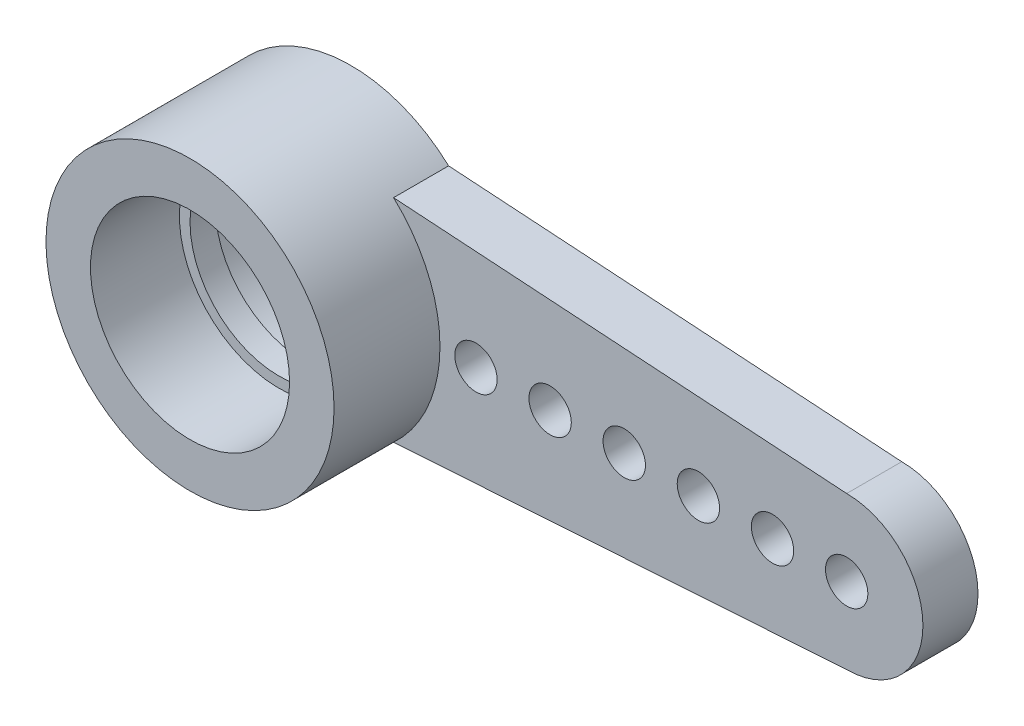
ISO-10303-21;
HEADER;
FILE_DESCRIPTION(('STEP AP214'),'2;1');
FILE_NAME('part.step','',(''),(''),'','','');
FILE_SCHEMA(('AUTOMOTIVE_DESIGN { 1 0 10303 214 1 1 1 1 }'));
ENDSEC;
DATA;
#1=APPLICATION_CONTEXT('core data for automotive mechanical design processes');
#2=APPLICATION_PROTOCOL_DEFINITION('international standard','automotive_design',2000,#1);
#3=PRODUCT_CONTEXT('',#1,'mechanical');
#4=PRODUCT('Part','Part','',(#3));
#5=PRODUCT_RELATED_PRODUCT_CATEGORY('part','',(#4));
#6=PRODUCT_DEFINITION_FORMATION('','',#4);
#7=PRODUCT_DEFINITION_CONTEXT('part definition',#1,'design');
#8=PRODUCT_DEFINITION('design','',#6,#7);
#9=PRODUCT_DEFINITION_SHAPE('','',#8);
#10=(LENGTH_UNIT() NAMED_UNIT(*) SI_UNIT(.MILLI.,.METRE.));
#11=(NAMED_UNIT(*) PLANE_ANGLE_UNIT() SI_UNIT($,.RADIAN.));
#12=(NAMED_UNIT(*) SI_UNIT($,.STERADIAN.) SOLID_ANGLE_UNIT());
#13=UNCERTAINTY_MEASURE_WITH_UNIT(LENGTH_MEASURE(1.E-05),#10,'distance_accuracy_value','');
#14=(GEOMETRIC_REPRESENTATION_CONTEXT(3) GLOBAL_UNCERTAINTY_ASSIGNED_CONTEXT((#13)) GLOBAL_UNIT_ASSIGNED_CONTEXT((#10,
#11,#12)) REPRESENTATION_CONTEXT('',''));
#15=CARTESIAN_POINT('',(0.,0.,0.));
#16=DIRECTION('',(0.,0.,1.));
#17=DIRECTION('',(1.,0.,0.));
#18=AXIS2_PLACEMENT_3D('',#15,#16,#17);
#19=CARTESIAN_POINT('',(0.,0.,-6.64680374315355));
#20=DIRECTION('',(0.,0.,1.));
#21=DIRECTION('',(1.,0.,0.));
#22=AXIS2_PLACEMENT_3D('',#19,#20,#21);
#23=CYLINDRICAL_SURFACE('',#22,2.35);
#24=CARTESIAN_POINT('',(0.,0.,1.1));
#25=DIRECTION('',(0.,0.,-1.));
#26=DIRECTION('',(-1.,0.,0.));
#27=AXIS2_PLACEMENT_3D('',#24,#25,#26);
#28=CIRCLE('',#27,2.35);
#29=CARTESIAN_POINT('',(-2.35,0.,1.1));
#30=VERTEX_POINT('',#29);
#31=EDGE_CURVE('E151',#30,#30,#28,.T.);
#32=ORIENTED_EDGE('',*,*,#31,.F.);
#33=EDGE_LOOP('',(#32));
#34=FACE_BOUND('',#33,.T.);
#35=CARTESIAN_POINT('',(0.,0.,0.));
#36=DIRECTION('',(0.,0.,1.));
#37=DIRECTION('',(1.,0.,0.));
#38=AXIS2_PLACEMENT_3D('',#35,#36,#37);
#39=CIRCLE('',#38,2.35);
#40=CARTESIAN_POINT('',(2.35,0.,0.));
#41=VERTEX_POINT('',#40);
#42=EDGE_CURVE('E122',#41,#41,#39,.F.);
#43=ORIENTED_EDGE('',*,*,#42,.T.);
#44=EDGE_LOOP('',(#43));
#45=FACE_BOUND('',#44,.T.);
#46=ADVANCED_FACE('F44',(#34,#45),#23,.F.);
#47=CARTESIAN_POINT('',(13.,0.,1.3));
#48=DIRECTION('',(0.,0.,-1.));
#49=DIRECTION('',(-1.,0.,0.));
#50=AXIS2_PLACEMENT_3D('',#47,#48,#49);
#51=CYLINDRICAL_SURFACE('',#50,1.8);
#52=CARTESIAN_POINT('',(13.,0.,0.));
#53=DIRECTION('',(0.,0.,1.));
#54=DIRECTION('',(1.,0.,0.));
#55=AXIS2_PLACEMENT_3D('',#52,#53,#54);
#56=CIRCLE('',#55,1.8);
#57=CARTESIAN_POINT('',(13.,-1.8,0.));
#58=VERTEX_POINT('',#57);
#59=CARTESIAN_POINT('',(13.,1.8,0.));
#60=VERTEX_POINT('',#59);
#61=EDGE_CURVE('E118',#58,#60,#56,.T.);
#62=ORIENTED_EDGE('',*,*,#61,.T.);
#63=DIRECTION('',(0.,0.,-1.));
#64=VECTOR('',#63,1.);
#65=CARTESIAN_POINT('',(13.,1.8,1.3));
#66=LINE('',#65,#64);
#67=CARTESIAN_POINT('',(13.,1.8,1.3));
#68=VERTEX_POINT('',#67);
#69=EDGE_CURVE('E48',#68,#60,#66,.T.);
#70=ORIENTED_EDGE('',*,*,#69,.F.);
#71=CARTESIAN_POINT('',(13.,0.,1.3));
#72=DIRECTION('',(0.,0.,1.));
#73=DIRECTION('',(1.,0.,0.));
#74=AXIS2_PLACEMENT_3D('',#71,#72,#73);
#75=CIRCLE('',#74,1.8);
#76=CARTESIAN_POINT('',(13.,-1.8,1.3));
#77=VERTEX_POINT('',#76);
#78=EDGE_CURVE('E102',#77,#68,#75,.T.);
#79=ORIENTED_EDGE('',*,*,#78,.F.);
#80=DIRECTION('',(0.,0.,-1.));
#81=VECTOR('',#80,1.);
#82=CARTESIAN_POINT('',(13.,-1.8,1.3));
#83=LINE('',#82,#81);
#84=EDGE_CURVE('E109',#77,#58,#83,.T.);
#85=ORIENTED_EDGE('',*,*,#84,.T.);
#86=EDGE_LOOP('',(#62,#70,#79,#85));
#87=FACE_BOUND('',#86,.T.);
#88=ADVANCED_FACE('F46',(#87),#51,.T.);
#89=CARTESIAN_POINT('',(13.,1.8,1.3));
#90=DIRECTION('',(-0.0653074123335915,-0.99786519224507,0.));
#91=DIRECTION('',(0.99786519224507,-0.0653074123335915,0.));
#92=AXIS2_PLACEMENT_3D('',#89,#90,#91);
#93=PLANE('',#92);
#94=DIRECTION('',(-0.99786519224507,0.0653074123335915,0.));
#95=VECTOR('',#94,1.);
#96=CARTESIAN_POINT('',(13.,1.8,0.));
#97=LINE('',#96,#95);
#98=CARTESIAN_POINT('',(2.30434372436058,2.5,0.));
#99=VERTEX_POINT('',#98);
#100=EDGE_CURVE('E97',#60,#99,#97,.T.);
#101=ORIENTED_EDGE('',*,*,#100,.T.);
#102=DIRECTION('',(0.,0.,-1.));
#103=VECTOR('',#102,1.);
#104=CARTESIAN_POINT('',(2.30434372436058,2.5,1.3));
#105=LINE('',#104,#103);
#106=CARTESIAN_POINT('',(2.30434372436058,2.5,1.3));
#107=VERTEX_POINT('',#106);
#108=EDGE_CURVE('E95',#107,#99,#105,.T.);
#109=ORIENTED_EDGE('',*,*,#108,.F.);
#110=DIRECTION('',(-0.99786519224507,0.0653074123335915,0.));
#111=VECTOR('',#110,1.);
#112=CARTESIAN_POINT('',(13.,1.8,1.3));
#113=LINE('',#112,#111);
#114=EDGE_CURVE('E93',#68,#107,#113,.T.);
#115=ORIENTED_EDGE('',*,*,#114,.F.);
#116=ORIENTED_EDGE('',*,*,#69,.T.);
#117=EDGE_LOOP('',(#101,#109,#115,#116));
#118=FACE_BOUND('',#117,.T.);
#119=ADVANCED_FACE('F96',(#118),#93,.F.);
#120=CARTESIAN_POINT('',(0.,0.,1.3));
#121=DIRECTION('',(0.,0.,-1.));
#122=DIRECTION('',(-1.,0.,0.));
#123=AXIS2_PLACEMENT_3D('',#120,#121,#122);
#124=CYLINDRICAL_SURFACE('',#123,3.4);
#125=CARTESIAN_POINT('',(0.,0.,0.));
#126=DIRECTION('',(0.,0.,1.));
#127=DIRECTION('',(1.,0.,0.));
#128=AXIS2_PLACEMENT_3D('',#125,#126,#127);
#129=CIRCLE('',#128,3.4);
#130=CARTESIAN_POINT('',(2.30434372436058,-2.5,0.));
#131=VERTEX_POINT('',#130);
#132=EDGE_CURVE('E81',#99,#131,#129,.T.);
#133=ORIENTED_EDGE('',*,*,#132,.T.);
#134=DIRECTION('',(0.,0.,-1.));
#135=VECTOR('',#134,1.);
#136=CARTESIAN_POINT('',(2.30434372436058,-2.5,1.3));
#137=LINE('',#136,#135);
#138=CARTESIAN_POINT('',(2.30434372436058,-2.5,1.3));
#139=VERTEX_POINT('',#138);
#140=EDGE_CURVE('E99',#139,#131,#137,.T.);
#141=ORIENTED_EDGE('',*,*,#140,.F.);
#142=CARTESIAN_POINT('',(0.,0.,1.3));
#143=DIRECTION('',(0.,0.,1.));
#144=DIRECTION('',(1.,0.,0.));
#145=AXIS2_PLACEMENT_3D('',#142,#143,#144);
#146=CIRCLE('',#145,3.4);
#147=EDGE_CURVE('E12',#139,#107,#146,.T.);
#148=ORIENTED_EDGE('',*,*,#147,.T.);
#149=ORIENTED_EDGE('',*,*,#108,.T.);
#150=EDGE_LOOP('',(#133,#141,#148,#149));
#151=FACE_BOUND('',#150,.T.);
#152=CARTESIAN_POINT('',(0.,0.,3.8));
#153=DIRECTION('',(0.,0.,1.));
#154=DIRECTION('',(1.,0.,0.));
#155=AXIS2_PLACEMENT_3D('',#152,#153,#154);
#156=CIRCLE('',#155,3.4);
#157=CARTESIAN_POINT('',(3.4,0.,3.8));
#158=VERTEX_POINT('',#157);
#159=EDGE_CURVE('E132',#158,#158,#156,.T.);
#160=ORIENTED_EDGE('',*,*,#159,.F.);
#161=EDGE_LOOP('',(#160));
#162=FACE_BOUND('',#161,.T.);
#163=ADVANCED_FACE('F106',(#151,#162),#124,.T.);
#164=CARTESIAN_POINT('',(13.,-1.8,1.3));
#165=DIRECTION('',(-0.0653074123335915,0.99786519224507,0.));
#166=DIRECTION('',(-0.99786519224507,-0.0653074123335915,0.));
#167=AXIS2_PLACEMENT_3D('',#164,#165,#166);
#168=PLANE('',#167);
#169=DIRECTION('',(0.99786519224507,0.0653074123335915,0.));
#170=VECTOR('',#169,1.);
#171=CARTESIAN_POINT('',(13.,-1.8,0.));
#172=LINE('',#171,#170);
#173=EDGE_CURVE('E86',#131,#58,#172,.T.);
#174=ORIENTED_EDGE('',*,*,#173,.T.);
#175=ORIENTED_EDGE('',*,*,#84,.F.);
#176=DIRECTION('',(0.99786519224507,0.0653074123335915,0.));
#177=VECTOR('',#176,1.);
#178=CARTESIAN_POINT('',(13.,-1.8,1.3));
#179=LINE('',#178,#177);
#180=EDGE_CURVE('E63',#139,#77,#179,.T.);
#181=ORIENTED_EDGE('',*,*,#180,.F.);
#182=ORIENTED_EDGE('',*,*,#140,.T.);
#183=EDGE_LOOP('',(#174,#175,#181,#182));
#184=FACE_BOUND('',#183,.T.);
#185=ADVANCED_FACE('F111',(#184),#168,.F.);
#186=CARTESIAN_POINT('',(13.,0.,1.3));
#187=DIRECTION('',(0.,0.,1.));
#188=DIRECTION('',(1.,0.,0.));
#189=AXIS2_PLACEMENT_3D('',#186,#187,#188);
#190=PLANE('',#189);
#191=CARTESIAN_POINT('',(13.,0.,1.3));
#192=DIRECTION('',(0.,0.,1.));
#193=DIRECTION('',(1.,0.,0.));
#194=AXIS2_PLACEMENT_3D('',#191,#192,#193);
#195=CIRCLE('',#194,0.500000000000001);
#196=CARTESIAN_POINT('',(13.5,0.,1.3));
#197=VERTEX_POINT('',#196);
#198=EDGE_CURVE('E198',#197,#197,#195,.F.);
#199=ORIENTED_EDGE('',*,*,#198,.T.);
#200=EDGE_LOOP('',(#199));
#201=FACE_BOUND('',#200,.T.);
#202=CARTESIAN_POINT('',(11.25,0.,1.3));
#203=DIRECTION('',(0.,0.,1.));
#204=DIRECTION('',(1.,0.,0.));
#205=AXIS2_PLACEMENT_3D('',#202,#203,#204);
#206=CIRCLE('',#205,0.500000000000001);
#207=CARTESIAN_POINT('',(11.75,0.,1.3));
#208=VERTEX_POINT('',#207);
#209=EDGE_CURVE('E190',#208,#208,#206,.F.);
#210=ORIENTED_EDGE('',*,*,#209,.T.);
#211=EDGE_LOOP('',(#210));
#212=FACE_BOUND('',#211,.T.);
#213=CARTESIAN_POINT('',(9.5,0.,1.3));
#214=DIRECTION('',(0.,0.,1.));
#215=DIRECTION('',(1.,0.,0.));
#216=AXIS2_PLACEMENT_3D('',#213,#214,#215);
#217=CIRCLE('',#216,0.500000000000001);
#218=CARTESIAN_POINT('',(10.,0.,1.3));
#219=VERTEX_POINT('',#218);
#220=EDGE_CURVE('E182',#219,#219,#217,.F.);
#221=ORIENTED_EDGE('',*,*,#220,.T.);
#222=EDGE_LOOP('',(#221));
#223=FACE_BOUND('',#222,.T.);
#224=CARTESIAN_POINT('',(7.75,0.,1.3));
#225=DIRECTION('',(0.,0.,1.));
#226=DIRECTION('',(1.,0.,0.));
#227=AXIS2_PLACEMENT_3D('',#224,#225,#226);
#228=CIRCLE('',#227,0.500000000000001);
#229=CARTESIAN_POINT('',(8.25,0.,1.3));
#230=VERTEX_POINT('',#229);
#231=EDGE_CURVE('E174',#230,#230,#228,.F.);
#232=ORIENTED_EDGE('',*,*,#231,.T.);
#233=EDGE_LOOP('',(#232));
#234=FACE_BOUND('',#233,.T.);
#235=CARTESIAN_POINT('',(6.,0.,1.3));
#236=DIRECTION('',(0.,0.,1.));
#237=DIRECTION('',(1.,0.,0.));
#238=AXIS2_PLACEMENT_3D('',#235,#236,#237);
#239=CIRCLE('',#238,0.500000000000001);
#240=CARTESIAN_POINT('',(6.5,0.,1.3));
#241=VERTEX_POINT('',#240);
#242=EDGE_CURVE('E166',#241,#241,#239,.F.);
#243=ORIENTED_EDGE('',*,*,#242,.T.);
#244=EDGE_LOOP('',(#243));
#245=FACE_BOUND('',#244,.T.);
#246=CARTESIAN_POINT('',(4.25,0.,1.3));
#247=DIRECTION('',(0.,0.,1.));
#248=DIRECTION('',(1.,0.,0.));
#249=AXIS2_PLACEMENT_3D('',#246,#247,#248);
#250=CIRCLE('',#249,0.500000000000001);
#251=CARTESIAN_POINT('',(4.75,0.,1.3));
#252=VERTEX_POINT('',#251);
#253=EDGE_CURVE('E158',#252,#252,#250,.F.);
#254=ORIENTED_EDGE('',*,*,#253,.T.);
#255=EDGE_LOOP('',(#254));
#256=FACE_BOUND('',#255,.T.);
#257=ORIENTED_EDGE('',*,*,#147,.F.);
#258=ORIENTED_EDGE('',*,*,#180,.T.);
#259=ORIENTED_EDGE('',*,*,#78,.T.);
#260=ORIENTED_EDGE('',*,*,#114,.T.);
#261=EDGE_LOOP('',(#257,#258,#259,#260));
#262=FACE_BOUND('',#261,.T.);
#263=ADVANCED_FACE('F100',(#201,#212,#223,#234,#245,#256,#262),#190,.T.);
#264=CARTESIAN_POINT('',(13.,0.,0.));
#265=DIRECTION('',(0.,0.,1.));
#266=DIRECTION('',(1.,0.,0.));
#267=AXIS2_PLACEMENT_3D('',#264,#265,#266);
#268=PLANE('',#267);
#269=CARTESIAN_POINT('',(13.,0.,0.));
#270=DIRECTION('',(0.,0.,-1.));
#271=DIRECTION('',(-1.,0.,0.));
#272=AXIS2_PLACEMENT_3D('',#269,#270,#271);
#273=CIRCLE('',#272,0.500000000000001);
#274=CARTESIAN_POINT('',(12.5,0.,0.));
#275=VERTEX_POINT('',#274);
#276=EDGE_CURVE('E147',#275,#275,#273,.T.);
#277=ORIENTED_EDGE('',*,*,#276,.F.);
#278=EDGE_LOOP('',(#277));
#279=FACE_BOUND('',#278,.T.);
#280=CARTESIAN_POINT('',(11.25,0.,0.));
#281=DIRECTION('',(0.,0.,-1.));
#282=DIRECTION('',(-1.,0.,0.));
#283=AXIS2_PLACEMENT_3D('',#280,#281,#282);
#284=CIRCLE('',#283,0.500000000000001);
#285=CARTESIAN_POINT('',(10.75,0.,0.));
#286=VERTEX_POINT('',#285);
#287=EDGE_CURVE('E194',#286,#286,#284,.T.);
#288=ORIENTED_EDGE('',*,*,#287,.F.);
#289=EDGE_LOOP('',(#288));
#290=FACE_BOUND('',#289,.T.);
#291=CARTESIAN_POINT('',(9.5,0.,0.));
#292=DIRECTION('',(0.,0.,-1.));
#293=DIRECTION('',(-1.,0.,0.));
#294=AXIS2_PLACEMENT_3D('',#291,#292,#293);
#295=CIRCLE('',#294,0.500000000000001);
#296=CARTESIAN_POINT('',(9.,0.,0.));
#297=VERTEX_POINT('',#296);
#298=EDGE_CURVE('E186',#297,#297,#295,.T.);
#299=ORIENTED_EDGE('',*,*,#298,.F.);
#300=EDGE_LOOP('',(#299));
#301=FACE_BOUND('',#300,.T.);
#302=CARTESIAN_POINT('',(7.75,0.,0.));
#303=DIRECTION('',(0.,0.,-1.));
#304=DIRECTION('',(-1.,0.,0.));
#305=AXIS2_PLACEMENT_3D('',#302,#303,#304);
#306=CIRCLE('',#305,0.500000000000001);
#307=CARTESIAN_POINT('',(7.25,0.,0.));
#308=VERTEX_POINT('',#307);
#309=EDGE_CURVE('E178',#308,#308,#306,.T.);
#310=ORIENTED_EDGE('',*,*,#309,.F.);
#311=EDGE_LOOP('',(#310));
#312=FACE_BOUND('',#311,.T.);
#313=CARTESIAN_POINT('',(6.,0.,0.));
#314=DIRECTION('',(0.,0.,-1.));
#315=DIRECTION('',(-1.,0.,0.));
#316=AXIS2_PLACEMENT_3D('',#313,#314,#315);
#317=CIRCLE('',#316,0.500000000000001);
#318=CARTESIAN_POINT('',(5.5,0.,0.));
#319=VERTEX_POINT('',#318);
#320=EDGE_CURVE('E170',#319,#319,#317,.T.);
#321=ORIENTED_EDGE('',*,*,#320,.F.);
#322=EDGE_LOOP('',(#321));
#323=FACE_BOUND('',#322,.T.);
#324=CARTESIAN_POINT('',(4.25,0.,0.));
#325=DIRECTION('',(0.,0.,-1.));
#326=DIRECTION('',(-1.,0.,0.));
#327=AXIS2_PLACEMENT_3D('',#324,#325,#326);
#328=CIRCLE('',#327,0.500000000000001);
#329=CARTESIAN_POINT('',(3.75,0.,0.));
#330=VERTEX_POINT('',#329);
#331=EDGE_CURVE('E162',#330,#330,#328,.T.);
#332=ORIENTED_EDGE('',*,*,#331,.F.);
#333=EDGE_LOOP('',(#332));
#334=FACE_BOUND('',#333,.T.);
#335=ORIENTED_EDGE('',*,*,#42,.F.);
#336=EDGE_LOOP('',(#335));
#337=FACE_BOUND('',#336,.T.);
#338=ORIENTED_EDGE('',*,*,#61,.F.);
#339=ORIENTED_EDGE('',*,*,#173,.F.);
#340=ORIENTED_EDGE('',*,*,#132,.F.);
#341=ORIENTED_EDGE('',*,*,#100,.F.);
#342=EDGE_LOOP('',(#338,#339,#340,#341));
#343=FACE_BOUND('',#342,.T.);
#344=ADVANCED_FACE('F208',(#279,#290,#301,#312,#323,#334,#337,#343),#268,.F.);
#345=CARTESIAN_POINT('',(0.,0.,1.7));
#346=DIRECTION('',(0.,0.,1.));
#347=DIRECTION('',(1.,0.,0.));
#348=AXIS2_PLACEMENT_3D('',#345,#346,#347);
#349=CIRCLE('',#348,2.35);
#350=CARTESIAN_POINT('',(2.35,0.,1.7));
#351=VERTEX_POINT('',#350);
#352=EDGE_CURVE('E142',#351,#351,#349,.F.);
#353=ORIENTED_EDGE('',*,*,#352,.T.);
#354=EDGE_LOOP('',(#353));
#355=FACE_BOUND('',#354,.T.);
#356=CARTESIAN_POINT('',(0.,0.,3.8));
#357=DIRECTION('',(0.,0.,1.));
#358=DIRECTION('',(1.,0.,0.));
#359=AXIS2_PLACEMENT_3D('',#356,#357,#358);
#360=CIRCLE('',#359,2.35);
#361=CARTESIAN_POINT('',(2.35,0.,3.8));
#362=VERTEX_POINT('',#361);
#363=EDGE_CURVE('E137',#362,#362,#360,.T.);
#364=ORIENTED_EDGE('',*,*,#363,.T.);
#365=EDGE_LOOP('',(#364));
#366=FACE_BOUND('',#365,.T.);
#367=ADVANCED_FACE('F211',(#355,#366),#23,.F.);
#368=CARTESIAN_POINT('',(0.,0.,3.8));
#369=DIRECTION('',(0.,0.,1.));
#370=DIRECTION('',(1.,0.,0.));
#371=AXIS2_PLACEMENT_3D('',#368,#369,#370);
#372=PLANE('',#371);
#373=ORIENTED_EDGE('',*,*,#159,.T.);
#374=EDGE_LOOP('',(#373));
#375=FACE_BOUND('',#374,.T.);
#376=ORIENTED_EDGE('',*,*,#363,.F.);
#377=EDGE_LOOP('',(#376));
#378=FACE_BOUND('',#377,.T.);
#379=ADVANCED_FACE('F242',(#375,#378),#372,.T.);
#380=CARTESIAN_POINT('',(0.,0.,10.4468037431535));
#381=DIRECTION('',(0.,0.,-1.));
#382=DIRECTION('',(-1.,0.,0.));
#383=AXIS2_PLACEMENT_3D('',#380,#381,#382);
#384=CYLINDRICAL_SURFACE('',#383,2.1);
#385=CARTESIAN_POINT('',(0.,0.,1.1));
#386=DIRECTION('',(0.,0.,-1.));
#387=DIRECTION('',(-1.,0.,0.));
#388=AXIS2_PLACEMENT_3D('',#385,#386,#387);
#389=CIRCLE('',#388,2.1);
#390=CARTESIAN_POINT('',(-2.1,0.,1.1));
#391=VERTEX_POINT('',#390);
#392=EDGE_CURVE('E146',#391,#391,#389,.T.);
#393=ORIENTED_EDGE('',*,*,#392,.T.);
#394=EDGE_LOOP('',(#393));
#395=FACE_BOUND('',#394,.T.);
#396=CARTESIAN_POINT('',(0.,0.,1.7));
#397=DIRECTION('',(0.,0.,1.));
#398=DIRECTION('',(1.,0.,0.));
#399=AXIS2_PLACEMENT_3D('',#396,#397,#398);
#400=CIRCLE('',#399,2.1);
#401=CARTESIAN_POINT('',(2.1,0.,1.7));
#402=VERTEX_POINT('',#401);
#403=EDGE_CURVE('E141',#402,#402,#400,.F.);
#404=ORIENTED_EDGE('',*,*,#403,.F.);
#405=EDGE_LOOP('',(#404));
#406=FACE_BOUND('',#405,.T.);
#407=ADVANCED_FACE('F247',(#395,#406),#384,.F.);
#408=CARTESIAN_POINT('',(0.,0.,1.1));
#409=DIRECTION('',(0.,0.,-1.));
#410=DIRECTION('',(-1.,0.,0.));
#411=AXIS2_PLACEMENT_3D('',#408,#409,#410);
#412=PLANE('',#411);
#413=ORIENTED_EDGE('',*,*,#392,.F.);
#414=EDGE_LOOP('',(#413));
#415=FACE_BOUND('',#414,.T.);
#416=ORIENTED_EDGE('',*,*,#31,.T.);
#417=EDGE_LOOP('',(#416));
#418=FACE_BOUND('',#417,.T.);
#419=ADVANCED_FACE('F258',(#415,#418),#412,.T.);
#420=CARTESIAN_POINT('',(0.,0.,1.7));
#421=DIRECTION('',(0.,0.,1.));
#422=DIRECTION('',(1.,0.,0.));
#423=AXIS2_PLACEMENT_3D('',#420,#421,#422);
#424=PLANE('',#423);
#425=ORIENTED_EDGE('',*,*,#352,.F.);
#426=EDGE_LOOP('',(#425));
#427=FACE_BOUND('',#426,.T.);
#428=ORIENTED_EDGE('',*,*,#403,.T.);
#429=EDGE_LOOP('',(#428));
#430=FACE_BOUND('',#429,.T.);
#431=ADVANCED_FACE('F254',(#427,#430),#424,.T.);
#432=CARTESIAN_POINT('',(4.25,0.,3.801));
#433=DIRECTION('',(0.,0.,-1.));
#434=DIRECTION('',(-1.,0.,0.));
#435=AXIS2_PLACEMENT_3D('',#432,#433,#434);
#436=CYLINDRICAL_SURFACE('',#435,0.500000000000001);
#437=ORIENTED_EDGE('',*,*,#253,.F.);
#438=EDGE_LOOP('',(#437));
#439=FACE_BOUND('',#438,.T.);
#440=ORIENTED_EDGE('',*,*,#331,.T.);
#441=EDGE_LOOP('',(#440));
#442=FACE_BOUND('',#441,.T.);
#443=ADVANCED_FACE('F257',(#439,#442),#436,.F.);
#444=CARTESIAN_POINT('',(6.,0.,3.801));
#445=DIRECTION('',(0.,0.,-1.));
#446=DIRECTION('',(-1.,0.,0.));
#447=AXIS2_PLACEMENT_3D('',#444,#445,#446);
#448=CYLINDRICAL_SURFACE('',#447,0.500000000000001);
#449=ORIENTED_EDGE('',*,*,#242,.F.);
#450=EDGE_LOOP('',(#449));
#451=FACE_BOUND('',#450,.T.);
#452=ORIENTED_EDGE('',*,*,#320,.T.);
#453=EDGE_LOOP('',(#452));
#454=FACE_BOUND('',#453,.T.);
#455=ADVANCED_FACE('F273',(#451,#454),#448,.F.);
#456=CARTESIAN_POINT('',(7.75,0.,3.801));
#457=DIRECTION('',(0.,0.,-1.));
#458=DIRECTION('',(-1.,0.,0.));
#459=AXIS2_PLACEMENT_3D('',#456,#457,#458);
#460=CYLINDRICAL_SURFACE('',#459,0.500000000000001);
#461=ORIENTED_EDGE('',*,*,#231,.F.);
#462=EDGE_LOOP('',(#461));
#463=FACE_BOUND('',#462,.T.);
#464=ORIENTED_EDGE('',*,*,#309,.T.);
#465=EDGE_LOOP('',(#464));
#466=FACE_BOUND('',#465,.T.);
#467=ADVANCED_FACE('F277',(#463,#466),#460,.F.);
#468=CARTESIAN_POINT('',(9.5,0.,3.801));
#469=DIRECTION('',(0.,0.,-1.));
#470=DIRECTION('',(-1.,0.,0.));
#471=AXIS2_PLACEMENT_3D('',#468,#469,#470);
#472=CYLINDRICAL_SURFACE('',#471,0.500000000000001);
#473=ORIENTED_EDGE('',*,*,#220,.F.);
#474=EDGE_LOOP('',(#473));
#475=FACE_BOUND('',#474,.T.);
#476=ORIENTED_EDGE('',*,*,#298,.T.);
#477=EDGE_LOOP('',(#476));
#478=FACE_BOUND('',#477,.T.);
#479=ADVANCED_FACE('F281',(#475,#478),#472,.F.);
#480=CARTESIAN_POINT('',(11.25,0.,3.801));
#481=DIRECTION('',(0.,0.,-1.));
#482=DIRECTION('',(-1.,0.,0.));
#483=AXIS2_PLACEMENT_3D('',#480,#481,#482);
#484=CYLINDRICAL_SURFACE('',#483,0.500000000000001);
#485=ORIENTED_EDGE('',*,*,#209,.F.);
#486=EDGE_LOOP('',(#485));
#487=FACE_BOUND('',#486,.T.);
#488=ORIENTED_EDGE('',*,*,#287,.T.);
#489=EDGE_LOOP('',(#488));
#490=FACE_BOUND('',#489,.T.);
#491=ADVANCED_FACE('F285',(#487,#490),#484,.F.);
#492=CARTESIAN_POINT('',(13.,0.,3.801));
#493=DIRECTION('',(0.,0.,-1.));
#494=DIRECTION('',(-1.,0.,0.));
#495=AXIS2_PLACEMENT_3D('',#492,#493,#494);
#496=CYLINDRICAL_SURFACE('',#495,0.500000000000001);
#497=ORIENTED_EDGE('',*,*,#198,.F.);
#498=EDGE_LOOP('',(#497));
#499=FACE_BOUND('',#498,.T.);
#500=ORIENTED_EDGE('',*,*,#276,.T.);
#501=EDGE_LOOP('',(#500));
#502=FACE_BOUND('',#501,.T.);
#503=ADVANCED_FACE('F206',(#499,#502),#496,.F.);
#504=CLOSED_SHELL('',(#46,#88,#119,#163,#185,#263,#344,#367,#379,#407,#419,#431,#443,#455,#467,
#479,#491,#503));
#505=MANIFOLD_SOLID_BREP('B2',#504);
#506=ADVANCED_BREP_SHAPE_REPRESENTATION('',(#18,#505),#14);
#507=SHAPE_DEFINITION_REPRESENTATION(#9,#506);
ENDSEC;
END-ISO-10303-21;
